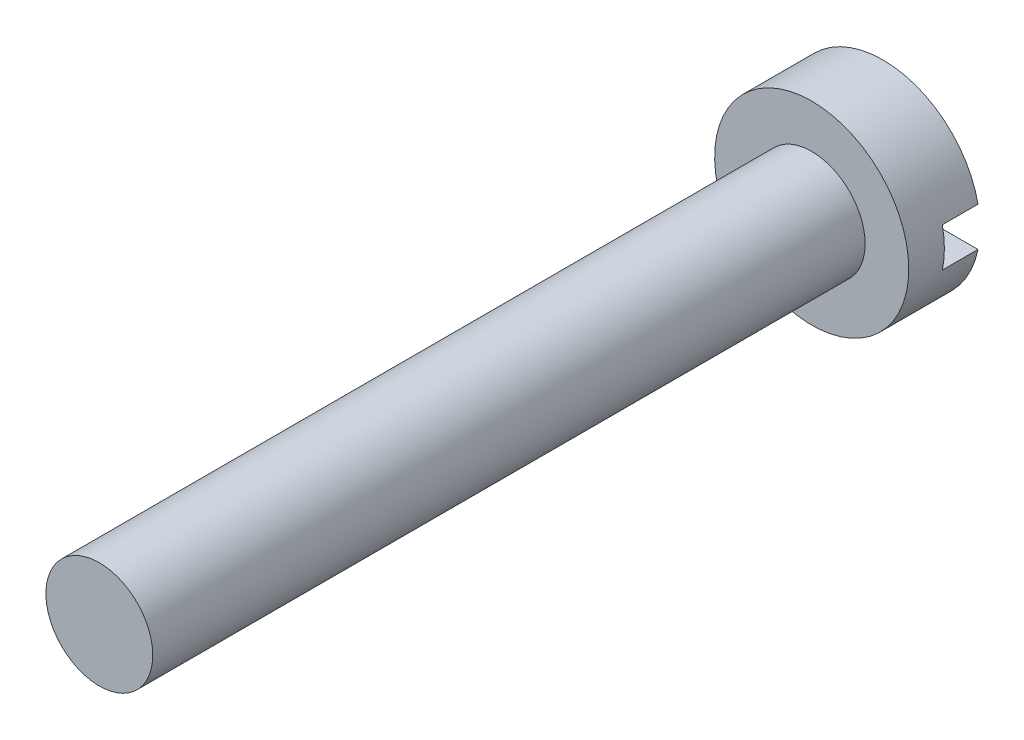
ISO-10303-21;
HEADER;
FILE_DESCRIPTION(('STEP AP214'),'2;1');
FILE_NAME('part.step','',(''),(''),'','','');
FILE_SCHEMA(('AUTOMOTIVE_DESIGN { 1 0 10303 214 1 1 1 1 }'));
ENDSEC;
DATA;
#1=APPLICATION_CONTEXT('core data for automotive mechanical design processes');
#2=APPLICATION_PROTOCOL_DEFINITION('international standard','automotive_design',2000,#1);
#3=PRODUCT_CONTEXT('',#1,'mechanical');
#4=PRODUCT('Part','Part','',(#3));
#5=PRODUCT_RELATED_PRODUCT_CATEGORY('part','',(#4));
#6=PRODUCT_DEFINITION_FORMATION('','',#4);
#7=PRODUCT_DEFINITION_CONTEXT('part definition',#1,'design');
#8=PRODUCT_DEFINITION('design','',#6,#7);
#9=PRODUCT_DEFINITION_SHAPE('','',#8);
#10=(LENGTH_UNIT() NAMED_UNIT(*) SI_UNIT(.MILLI.,.METRE.));
#11=(NAMED_UNIT(*) PLANE_ANGLE_UNIT() SI_UNIT($,.RADIAN.));
#12=(NAMED_UNIT(*) SI_UNIT($,.STERADIAN.) SOLID_ANGLE_UNIT());
#13=UNCERTAINTY_MEASURE_WITH_UNIT(LENGTH_MEASURE(1.E-05),#10,'distance_accuracy_value','');
#14=(GEOMETRIC_REPRESENTATION_CONTEXT(3) GLOBAL_UNCERTAINTY_ASSIGNED_CONTEXT((#13)) GLOBAL_UNIT_ASSIGNED_CONTEXT((#10,
#11,#12)) REPRESENTATION_CONTEXT('',''));
#15=CARTESIAN_POINT('',(0.,0.,0.));
#16=DIRECTION('',(0.,0.,1.));
#17=DIRECTION('',(1.,0.,0.));
#18=AXIS2_PLACEMENT_3D('',#15,#16,#17);
#19=CARTESIAN_POINT('',(0.,0.,2.));
#20=DIRECTION('',(0.,0.,1.));
#21=DIRECTION('',(1.,0.,0.));
#22=AXIS2_PLACEMENT_3D('',#19,#20,#21);
#23=PLANE('',#22);
#24=CARTESIAN_POINT('',(0.,0.,2.));
#25=DIRECTION('',(0.,0.,1.));
#26=DIRECTION('',(1.,0.,0.));
#27=AXIS2_PLACEMENT_3D('',#24,#25,#26);
#28=CIRCLE('',#27,2.725);
#29=CARTESIAN_POINT('',(2.725,0.,2.));
#30=VERTEX_POINT('',#29);
#31=EDGE_CURVE('E82',#30,#30,#28,.T.);
#32=ORIENTED_EDGE('',*,*,#31,.T.);
#33=EDGE_LOOP('',(#32));
#34=FACE_BOUND('',#33,.T.);
#35=CARTESIAN_POINT('',(0.,0.,2.));
#36=DIRECTION('',(0.,0.,1.));
#37=DIRECTION('',(1.,0.,0.));
#38=AXIS2_PLACEMENT_3D('',#35,#36,#37);
#39=CIRCLE('',#38,1.5);
#40=CARTESIAN_POINT('',(1.5,0.,2.));
#41=VERTEX_POINT('',#40);
#42=EDGE_CURVE('E148',#41,#41,#39,.T.);
#43=ORIENTED_EDGE('',*,*,#42,.F.);
#44=EDGE_LOOP('',(#43));
#45=FACE_BOUND('',#44,.T.);
#46=ADVANCED_FACE('F34',(#34,#45),#23,.T.);
#47=CARTESIAN_POINT('',(0.,0.,0.));
#48=DIRECTION('',(0.,0.,1.));
#49=DIRECTION('',(1.,0.,0.));
#50=AXIS2_PLACEMENT_3D('',#47,#48,#49);
#51=PLANE('',#50);
#52=CARTESIAN_POINT('',(0.,0.,0.));
#53=DIRECTION('',(0.,0.,1.));
#54=DIRECTION('',(1.,0.,0.));
#55=AXIS2_PLACEMENT_3D('',#52,#53,#54);
#56=CIRCLE('',#55,2.725);
#57=CARTESIAN_POINT('',(-2.66891832021889,-0.55,0.));
#58=VERTEX_POINT('',#57);
#59=CARTESIAN_POINT('',(2.66891832021889,-0.55,0.));
#60=VERTEX_POINT('',#59);
#61=EDGE_CURVE('E93',#58,#60,#56,.T.);
#62=ORIENTED_EDGE('',*,*,#61,.F.);
#63=DIRECTION('',(1.,0.,0.));
#64=VECTOR('',#63,1.);
#65=CARTESIAN_POINT('',(0.,-0.55,0.));
#66=LINE('',#65,#64);
#67=EDGE_CURVE('E81',#58,#60,#66,.T.);
#68=ORIENTED_EDGE('',*,*,#67,.T.);
#69=EDGE_LOOP('',(#62,#68));
#70=FACE_BOUND('',#69,.T.);
#71=ADVANCED_FACE('F111',(#70),#51,.F.);
#72=CARTESIAN_POINT('',(0.,0.,2.));
#73=DIRECTION('',(0.,0.,-1.));
#74=DIRECTION('',(-1.,0.,0.));
#75=AXIS2_PLACEMENT_3D('',#72,#73,#74);
#76=CYLINDRICAL_SURFACE('',#75,2.725);
#77=ORIENTED_EDGE('',*,*,#61,.T.);
#78=DIRECTION('',(0.,0.,-1.));
#79=VECTOR('',#78,1.);
#80=CARTESIAN_POINT('',(2.66891832021889,-0.55,2.));
#81=LINE('',#80,#79);
#82=CARTESIAN_POINT('',(2.66891832021889,-0.55,1.));
#83=VERTEX_POINT('',#82);
#84=EDGE_CURVE('E90',#60,#83,#81,.F.);
#85=ORIENTED_EDGE('',*,*,#84,.T.);
#86=CARTESIAN_POINT('',(0.,0.,1.));
#87=DIRECTION('',(0.,0.,-1.));
#88=DIRECTION('',(-1.,0.,0.));
#89=AXIS2_PLACEMENT_3D('',#86,#87,#88);
#90=CIRCLE('',#89,2.725);
#91=CARTESIAN_POINT('',(2.66891832021889,0.55,1.));
#92=VERTEX_POINT('',#91);
#93=EDGE_CURVE('E11',#92,#83,#90,.T.);
#94=ORIENTED_EDGE('',*,*,#93,.F.);
#95=DIRECTION('',(0.,0.,-1.));
#96=VECTOR('',#95,1.);
#97=CARTESIAN_POINT('',(2.66891832021889,0.55,2.));
#98=LINE('',#97,#96);
#99=CARTESIAN_POINT('',(2.66891832021889,0.55,0.));
#100=VERTEX_POINT('',#99);
#101=EDGE_CURVE('E76',#92,#100,#98,.T.);
#102=ORIENTED_EDGE('',*,*,#101,.T.);
#103=CARTESIAN_POINT('',(-2.66891832021889,0.55,0.));
#104=VERTEX_POINT('',#103);
#105=EDGE_CURVE('E88',#100,#104,#56,.T.);
#106=ORIENTED_EDGE('',*,*,#105,.T.);
#107=DIRECTION('',(0.,0.,-1.));
#108=VECTOR('',#107,1.);
#109=CARTESIAN_POINT('',(-2.66891832021889,0.55,2.));
#110=LINE('',#109,#108);
#111=CARTESIAN_POINT('',(-2.66891832021889,0.55,1.));
#112=VERTEX_POINT('',#111);
#113=EDGE_CURVE('E49',#104,#112,#110,.F.);
#114=ORIENTED_EDGE('',*,*,#113,.T.);
#115=CARTESIAN_POINT('',(-2.66891832021889,-0.55,1.));
#116=VERTEX_POINT('',#115);
#117=EDGE_CURVE('E38',#116,#112,#90,.T.);
#118=ORIENTED_EDGE('',*,*,#117,.F.);
#119=DIRECTION('',(0.,0.,-1.));
#120=VECTOR('',#119,1.);
#121=CARTESIAN_POINT('',(-2.66891832021889,-0.55,2.));
#122=LINE('',#121,#120);
#123=EDGE_CURVE('E57',#116,#58,#122,.T.);
#124=ORIENTED_EDGE('',*,*,#123,.T.);
#125=EDGE_LOOP('',(#77,#85,#94,#102,#106,#114,#118,#124));
#126=FACE_BOUND('',#125,.T.);
#127=ORIENTED_EDGE('',*,*,#31,.F.);
#128=EDGE_LOOP('',(#127));
#129=FACE_BOUND('',#128,.T.);
#130=ADVANCED_FACE('F36',(#126,#129),#76,.T.);
#131=ORIENTED_EDGE('',*,*,#105,.F.);
#132=DIRECTION('',(-1.,0.,0.));
#133=VECTOR('',#132,1.);
#134=CARTESIAN_POINT('',(0.,0.55,0.));
#135=LINE('',#134,#133);
#136=EDGE_CURVE('E73',#100,#104,#135,.T.);
#137=ORIENTED_EDGE('',*,*,#136,.T.);
#138=EDGE_LOOP('',(#131,#137));
#139=FACE_BOUND('',#138,.T.);
#140=ADVANCED_FACE('F92',(#139),#51,.F.);
#141=CARTESIAN_POINT('',(-3.44980190887808,0.55,1.));
#142=DIRECTION('',(0.,0.,-1.));
#143=DIRECTION('',(-1.,0.,0.));
#144=AXIS2_PLACEMENT_3D('',#141,#142,#143);
#145=PLANE('',#144);
#146=ORIENTED_EDGE('',*,*,#93,.T.);
#147=DIRECTION('',(-1.,0.,0.));
#148=VECTOR('',#147,1.);
#149=CARTESIAN_POINT('',(3.90126958400864,-0.55,1.));
#150=LINE('',#149,#148);
#151=EDGE_CURVE('E106',#83,#116,#150,.T.);
#152=ORIENTED_EDGE('',*,*,#151,.T.);
#153=ORIENTED_EDGE('',*,*,#117,.T.);
#154=DIRECTION('',(1.,0.,0.));
#155=VECTOR('',#154,1.);
#156=CARTESIAN_POINT('',(-3.44980190887808,0.55,1.));
#157=LINE('',#156,#155);
#158=EDGE_CURVE('E105',#112,#92,#157,.T.);
#159=ORIENTED_EDGE('',*,*,#158,.T.);
#160=EDGE_LOOP('',(#146,#152,#153,#159));
#161=FACE_BOUND('',#160,.T.);
#162=ADVANCED_FACE('F104',(#161),#145,.T.);
#163=CARTESIAN_POINT('',(3.90126958400864,-0.55,1.));
#164=DIRECTION('',(0.,-1.,0.));
#165=DIRECTION('',(0.,0.,-1.));
#166=AXIS2_PLACEMENT_3D('',#163,#164,#165);
#167=PLANE('',#166);
#168=ORIENTED_EDGE('',*,*,#151,.F.);
#169=ORIENTED_EDGE('',*,*,#84,.F.);
#170=ORIENTED_EDGE('',*,*,#67,.F.);
#171=ORIENTED_EDGE('',*,*,#123,.F.);
#172=EDGE_LOOP('',(#168,#169,#170,#171));
#173=FACE_BOUND('',#172,.T.);
#174=ADVANCED_FACE('F124',(#173),#167,.F.);
#175=CARTESIAN_POINT('',(-3.44980190887808,0.55,1.));
#176=DIRECTION('',(0.,1.,0.));
#177=DIRECTION('',(0.,0.,1.));
#178=AXIS2_PLACEMENT_3D('',#175,#176,#177);
#179=PLANE('',#178);
#180=ORIENTED_EDGE('',*,*,#158,.F.);
#181=ORIENTED_EDGE('',*,*,#113,.F.);
#182=ORIENTED_EDGE('',*,*,#136,.F.);
#183=ORIENTED_EDGE('',*,*,#101,.F.);
#184=EDGE_LOOP('',(#180,#181,#182,#183));
#185=FACE_BOUND('',#184,.T.);
#186=ADVANCED_FACE('F75',(#185),#179,.F.);
#187=CARTESIAN_POINT('',(0.,0.,22.));
#188=DIRECTION('',(0.,0.,-1.));
#189=DIRECTION('',(-1.,0.,0.));
#190=AXIS2_PLACEMENT_3D('',#187,#188,#189);
#191=CYLINDRICAL_SURFACE('',#190,1.5);
#192=CARTESIAN_POINT('',(0.,0.,22.));
#193=DIRECTION('',(0.,0.,1.));
#194=DIRECTION('',(1.,0.,0.));
#195=AXIS2_PLACEMENT_3D('',#192,#193,#194);
#196=CIRCLE('',#195,1.5);
#197=CARTESIAN_POINT('',(1.5,0.,22.));
#198=VERTEX_POINT('',#197);
#199=EDGE_CURVE('E107',#198,#198,#196,.T.);
#200=ORIENTED_EDGE('',*,*,#199,.F.);
#201=EDGE_LOOP('',(#200));
#202=FACE_BOUND('',#201,.T.);
#203=ORIENTED_EDGE('',*,*,#42,.T.);
#204=EDGE_LOOP('',(#203));
#205=FACE_BOUND('',#204,.T.);
#206=ADVANCED_FACE('F131',(#202,#205),#191,.T.);
#207=CARTESIAN_POINT('',(0.,0.,22.));
#208=DIRECTION('',(0.,0.,1.));
#209=DIRECTION('',(1.,0.,0.));
#210=AXIS2_PLACEMENT_3D('',#207,#208,#209);
#211=PLANE('',#210);
#212=ORIENTED_EDGE('',*,*,#199,.T.);
#213=EDGE_LOOP('',(#212));
#214=FACE_BOUND('',#213,.T.);
#215=ADVANCED_FACE('F137',(#214),#211,.T.);
#216=CLOSED_SHELL('',(#46,#71,#130,#140,#162,#174,#186,#206,#215));
#217=MANIFOLD_SOLID_BREP('B2',#216);
#218=ADVANCED_BREP_SHAPE_REPRESENTATION('',(#18,#217),#14);
#219=SHAPE_DEFINITION_REPRESENTATION(#9,#218);
ENDSEC;
END-ISO-10303-21;
